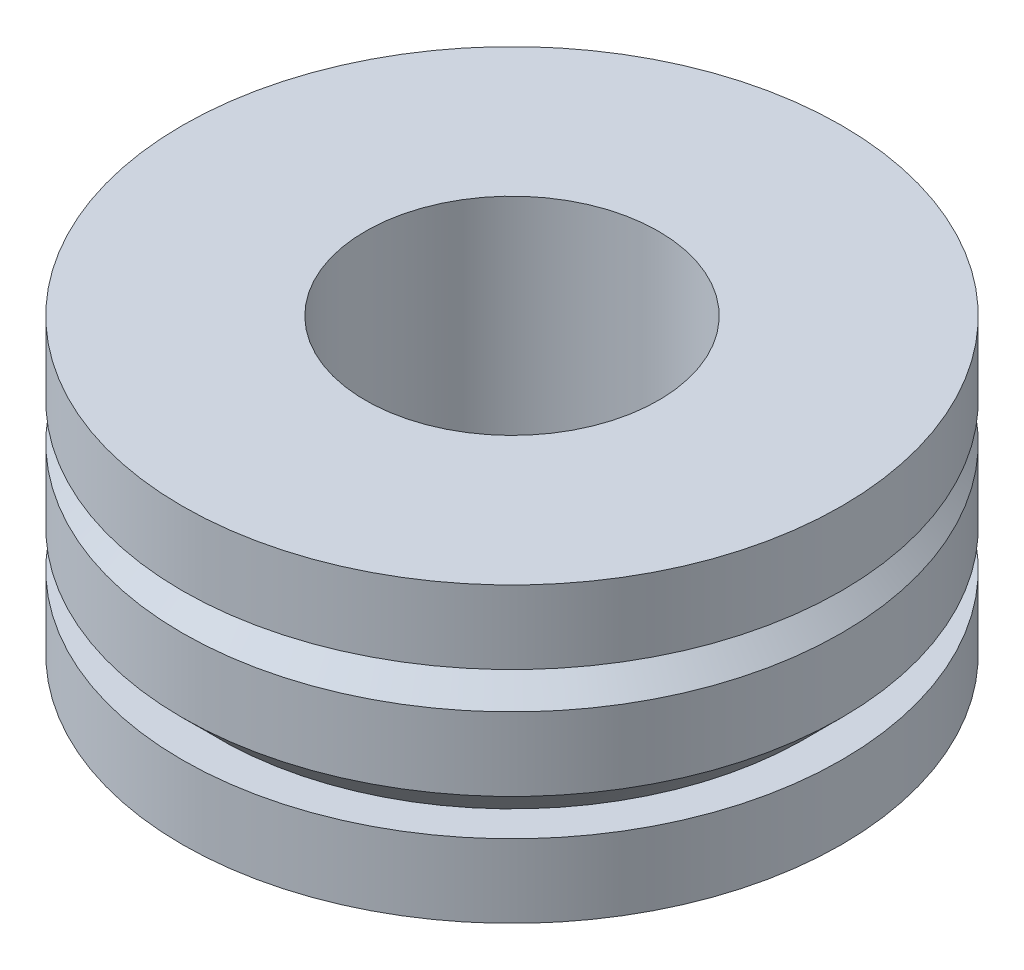
ISO-10303-21;
HEADER;
FILE_DESCRIPTION(('STEP AP214'),'2;1');
FILE_NAME('part.step','',(''),(''),'','','');
FILE_SCHEMA(('AUTOMOTIVE_DESIGN { 1 0 10303 214 1 1 1 1 }'));
ENDSEC;
DATA;
#1=APPLICATION_CONTEXT('core data for automotive mechanical design processes');
#2=APPLICATION_PROTOCOL_DEFINITION('international standard','automotive_design',2000,#1);
#3=PRODUCT_CONTEXT('',#1,'mechanical');
#4=PRODUCT('Part','Part','',(#3));
#5=PRODUCT_RELATED_PRODUCT_CATEGORY('part','',(#4));
#6=PRODUCT_DEFINITION_FORMATION('','',#4);
#7=PRODUCT_DEFINITION_CONTEXT('part definition',#1,'design');
#8=PRODUCT_DEFINITION('design','',#6,#7);
#9=PRODUCT_DEFINITION_SHAPE('','',#8);
#10=(LENGTH_UNIT() NAMED_UNIT(*) SI_UNIT(.MILLI.,.METRE.));
#11=(NAMED_UNIT(*) PLANE_ANGLE_UNIT() SI_UNIT($,.RADIAN.));
#12=(NAMED_UNIT(*) SI_UNIT($,.STERADIAN.) SOLID_ANGLE_UNIT());
#13=UNCERTAINTY_MEASURE_WITH_UNIT(LENGTH_MEASURE(1.E-05),#10,'distance_accuracy_value','');
#14=(GEOMETRIC_REPRESENTATION_CONTEXT(3) GLOBAL_UNCERTAINTY_ASSIGNED_CONTEXT((#13)) GLOBAL_UNIT_ASSIGNED_CONTEXT((#10,
#11,#12)) REPRESENTATION_CONTEXT('',''));
#15=CARTESIAN_POINT('',(0.,0.,0.));
#16=DIRECTION('',(0.,0.,1.));
#17=DIRECTION('',(1.,0.,0.));
#18=AXIS2_PLACEMENT_3D('',#15,#16,#17);
#19=CARTESIAN_POINT('',(-90.,4.,0.));
#20=DIRECTION('',(0.,-1.,0.));
#21=DIRECTION('',(0.,0.,-1.));
#22=AXIS2_PLACEMENT_3D('',#19,#20,#21);
#23=CYLINDRICAL_SURFACE('',#22,4.5);
#24=CARTESIAN_POINT('',(-90.,4.,0.));
#25=DIRECTION('',(0.,-1.,0.));
#26=DIRECTION('',(0.,0.,-1.));
#27=AXIS2_PLACEMENT_3D('',#24,#25,#26);
#28=CIRCLE('',#27,4.5);
#29=CARTESIAN_POINT('',(-90.,4.,-4.5));
#30=VERTEX_POINT('',#29);
#31=EDGE_CURVE('E10',#30,#30,#28,.T.);
#32=ORIENTED_EDGE('',*,*,#31,.T.);
#33=EDGE_LOOP('',(#32));
#34=FACE_BOUND('',#33,.T.);
#35=CARTESIAN_POINT('',(-90.,3.,0.));
#36=DIRECTION('',(0.,-1.,0.));
#37=DIRECTION('',(0.,0.,-1.));
#38=AXIS2_PLACEMENT_3D('',#35,#36,#37);
#39=CIRCLE('',#38,4.5);
#40=CARTESIAN_POINT('',(-90.,3.,-4.5));
#41=VERTEX_POINT('',#40);
#42=EDGE_CURVE('E65',#41,#41,#39,.T.);
#43=ORIENTED_EDGE('',*,*,#42,.F.);
#44=EDGE_LOOP('',(#43));
#45=FACE_BOUND('',#44,.T.);
#46=ADVANCED_FACE('F31',(#34,#45),#23,.T.);
#47=CARTESIAN_POINT('',(-85.5,4.,0.));
#48=DIRECTION('',(0.,1.,0.));
#49=DIRECTION('',(0.,0.,1.));
#50=AXIS2_PLACEMENT_3D('',#47,#48,#49);
#51=PLANE('',#50);
#52=CARTESIAN_POINT('',(-90.,4.,0.));
#53=DIRECTION('',(0.,-1.,0.));
#54=DIRECTION('',(0.,0.,-1.));
#55=AXIS2_PLACEMENT_3D('',#52,#53,#54);
#56=CIRCLE('',#55,2.);
#57=CARTESIAN_POINT('',(-90.,4.,-2.));
#58=VERTEX_POINT('',#57);
#59=EDGE_CURVE('E37',#58,#58,#56,.T.);
#60=ORIENTED_EDGE('',*,*,#59,.T.);
#61=EDGE_LOOP('',(#60));
#62=FACE_BOUND('',#61,.T.);
#63=ORIENTED_EDGE('',*,*,#31,.F.);
#64=EDGE_LOOP('',(#63));
#65=FACE_BOUND('',#64,.T.);
#66=ADVANCED_FACE('F73',(#62,#65),#51,.T.);
#67=CARTESIAN_POINT('',(-90.,4.,0.));
#68=DIRECTION('',(0.,-1.,0.));
#69=DIRECTION('',(0.,0.,-1.));
#70=AXIS2_PLACEMENT_3D('',#67,#68,#69);
#71=CYLINDRICAL_SURFACE('',#70,2.);
#72=CARTESIAN_POINT('',(-90.,0.,0.));
#73=DIRECTION('',(0.,-1.,0.));
#74=DIRECTION('',(0.,0.,-1.));
#75=AXIS2_PLACEMENT_3D('',#72,#73,#74);
#76=CIRCLE('',#75,2.);
#77=CARTESIAN_POINT('',(-90.,0.,-2.));
#78=VERTEX_POINT('',#77);
#79=EDGE_CURVE('E41',#78,#78,#76,.T.);
#80=ORIENTED_EDGE('',*,*,#79,.T.);
#81=EDGE_LOOP('',(#80));
#82=FACE_BOUND('',#81,.T.);
#83=ORIENTED_EDGE('',*,*,#59,.F.);
#84=EDGE_LOOP('',(#83));
#85=FACE_BOUND('',#84,.T.);
#86=ADVANCED_FACE('F77',(#82,#85),#71,.F.);
#87=CARTESIAN_POINT('',(-88.,0.,0.));
#88=DIRECTION('',(0.,-1.,0.));
#89=DIRECTION('',(0.,0.,-1.));
#90=AXIS2_PLACEMENT_3D('',#87,#88,#89);
#91=PLANE('',#90);
#92=CARTESIAN_POINT('',(-90.,0.,0.));
#93=DIRECTION('',(0.,-1.,0.));
#94=DIRECTION('',(0.,0.,-1.));
#95=AXIS2_PLACEMENT_3D('',#92,#93,#94);
#96=CIRCLE('',#95,4.5);
#97=CARTESIAN_POINT('',(-90.,0.,-4.5));
#98=VERTEX_POINT('',#97);
#99=EDGE_CURVE('E45',#98,#98,#96,.T.);
#100=ORIENTED_EDGE('',*,*,#99,.T.);
#101=EDGE_LOOP('',(#100));
#102=FACE_BOUND('',#101,.T.);
#103=ORIENTED_EDGE('',*,*,#79,.F.);
#104=EDGE_LOOP('',(#103));
#105=FACE_BOUND('',#104,.T.);
#106=ADVANCED_FACE('F81',(#102,#105),#91,.T.);
#107=CARTESIAN_POINT('',(-90.,4.,0.));
#108=DIRECTION('',(0.,-1.,0.));
#109=DIRECTION('',(0.,0.,-1.));
#110=AXIS2_PLACEMENT_3D('',#107,#108,#109);
#111=CYLINDRICAL_SURFACE('',#110,4.5);
#112=CARTESIAN_POINT('',(-90.,1.,0.));
#113=DIRECTION('',(0.,-1.,0.));
#114=DIRECTION('',(0.,0.,-1.));
#115=AXIS2_PLACEMENT_3D('',#112,#113,#114);
#116=CIRCLE('',#115,4.5);
#117=CARTESIAN_POINT('',(-90.,1.,-4.5));
#118=VERTEX_POINT('',#117);
#119=EDGE_CURVE('E50',#118,#118,#116,.T.);
#120=ORIENTED_EDGE('',*,*,#119,.T.);
#121=EDGE_LOOP('',(#120));
#122=FACE_BOUND('',#121,.T.);
#123=ORIENTED_EDGE('',*,*,#99,.F.);
#124=EDGE_LOOP('',(#123));
#125=FACE_BOUND('',#124,.T.);
#126=ADVANCED_FACE('F88',(#122,#125),#111,.T.);
#127=CARTESIAN_POINT('',(-85.5,0.999999999999994,0.));
#128=DIRECTION('',(0.,1.,0.));
#129=DIRECTION('',(0.,0.,1.));
#130=AXIS2_PLACEMENT_3D('',#127,#128,#129);
#131=PLANE('',#130);
#132=CARTESIAN_POINT('',(-90.,0.999999999999987,0.));
#133=DIRECTION('',(0.,-1.,0.));
#134=DIRECTION('',(0.,0.,-1.));
#135=AXIS2_PLACEMENT_3D('',#132,#133,#134);
#136=CIRCLE('',#135,4.);
#137=CARTESIAN_POINT('',(-90.,0.999999999999987,-4.));
#138=VERTEX_POINT('',#137);
#139=EDGE_CURVE('E53',#138,#138,#136,.T.);
#140=ORIENTED_EDGE('',*,*,#139,.T.);
#141=EDGE_LOOP('',(#140));
#142=FACE_BOUND('',#141,.T.);
#143=ORIENTED_EDGE('',*,*,#119,.F.);
#144=EDGE_LOOP('',(#143));
#145=FACE_BOUND('',#144,.T.);
#146=ADVANCED_FACE('F92',(#142,#145),#131,.T.);
#147=CARTESIAN_POINT('',(-90.,0.999999999999987,0.));
#148=DIRECTION('',(0.,1.,0.));
#149=DIRECTION('',(0.,0.,1.));
#150=AXIS2_PLACEMENT_3D('',#147,#148,#149);
#151=CONICAL_SURFACE('',#150,4.,0.78539816339745);
#152=CARTESIAN_POINT('',(-90.,1.49999999999999,0.));
#153=DIRECTION('',(0.,-1.,0.));
#154=DIRECTION('',(0.,0.,-1.));
#155=AXIS2_PLACEMENT_3D('',#152,#153,#154);
#156=CIRCLE('',#155,4.5);
#157=CARTESIAN_POINT('',(-90.,1.49999999999999,-4.5));
#158=VERTEX_POINT('',#157);
#159=EDGE_CURVE('E56',#158,#158,#156,.T.);
#160=ORIENTED_EDGE('',*,*,#159,.T.);
#161=EDGE_LOOP('',(#160));
#162=FACE_BOUND('',#161,.T.);
#163=ORIENTED_EDGE('',*,*,#139,.F.);
#164=EDGE_LOOP('',(#163));
#165=FACE_BOUND('',#164,.T.);
#166=ADVANCED_FACE('F96',(#162,#165),#151,.T.);
#167=CARTESIAN_POINT('',(-90.,4.,0.));
#168=DIRECTION('',(0.,-1.,0.));
#169=DIRECTION('',(0.,0.,-1.));
#170=AXIS2_PLACEMENT_3D('',#167,#168,#169);
#171=CYLINDRICAL_SURFACE('',#170,4.5);
#172=CARTESIAN_POINT('',(-90.,2.5,0.));
#173=DIRECTION('',(0.,-1.,0.));
#174=DIRECTION('',(0.,0.,-1.));
#175=AXIS2_PLACEMENT_3D('',#172,#173,#174);
#176=CIRCLE('',#175,4.5);
#177=CARTESIAN_POINT('',(-90.,2.5,-4.5));
#178=VERTEX_POINT('',#177);
#179=EDGE_CURVE('E59',#178,#178,#176,.T.);
#180=ORIENTED_EDGE('',*,*,#179,.T.);
#181=EDGE_LOOP('',(#180));
#182=FACE_BOUND('',#181,.T.);
#183=ORIENTED_EDGE('',*,*,#159,.F.);
#184=EDGE_LOOP('',(#183));
#185=FACE_BOUND('',#184,.T.);
#186=ADVANCED_FACE('F100',(#182,#185),#171,.T.);
#187=CARTESIAN_POINT('',(-90.,2.5,0.));
#188=DIRECTION('',(0.,-1.,0.));
#189=DIRECTION('',(0.,0.,-1.));
#190=AXIS2_PLACEMENT_3D('',#187,#188,#189);
#191=CONICAL_SURFACE('',#190,4.5,0.785398163397449);
#192=CARTESIAN_POINT('',(-90.,3.,0.));
#193=DIRECTION('',(0.,-1.,0.));
#194=DIRECTION('',(0.,0.,-1.));
#195=AXIS2_PLACEMENT_3D('',#192,#193,#194);
#196=CIRCLE('',#195,4.);
#197=CARTESIAN_POINT('',(-90.,3.,-4.));
#198=VERTEX_POINT('',#197);
#199=EDGE_CURVE('E62',#198,#198,#196,.T.);
#200=ORIENTED_EDGE('',*,*,#199,.T.);
#201=EDGE_LOOP('',(#200));
#202=FACE_BOUND('',#201,.T.);
#203=ORIENTED_EDGE('',*,*,#179,.F.);
#204=EDGE_LOOP('',(#203));
#205=FACE_BOUND('',#204,.T.);
#206=ADVANCED_FACE('F104',(#202,#205),#191,.T.);
#207=CARTESIAN_POINT('',(-86.,3.,0.));
#208=DIRECTION('',(0.,-1.,0.));
#209=DIRECTION('',(0.,0.,-1.));
#210=AXIS2_PLACEMENT_3D('',#207,#208,#209);
#211=PLANE('',#210);
#212=ORIENTED_EDGE('',*,*,#42,.T.);
#213=EDGE_LOOP('',(#212));
#214=FACE_BOUND('',#213,.T.);
#215=ORIENTED_EDGE('',*,*,#199,.F.);
#216=EDGE_LOOP('',(#215));
#217=FACE_BOUND('',#216,.T.);
#218=ADVANCED_FACE('F69',(#214,#217),#211,.T.);
#219=CLOSED_SHELL('',(#46,#66,#86,#106,#126,#146,#166,#186,#206,#218));
#220=MANIFOLD_SOLID_BREP('B2',#219);
#221=ADVANCED_BREP_SHAPE_REPRESENTATION('',(#18,#220),#14);
#222=SHAPE_DEFINITION_REPRESENTATION(#9,#221);
ENDSEC;
END-ISO-10303-21;
